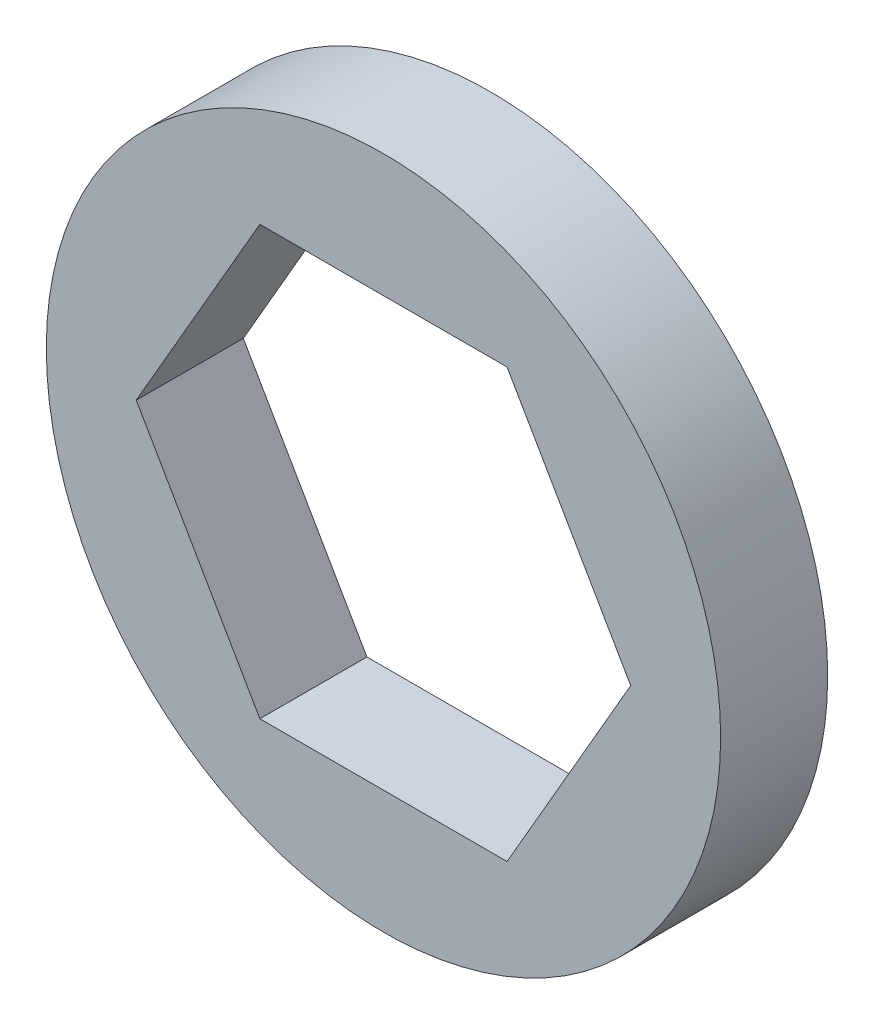
ISO-10303-21;
HEADER;
FILE_DESCRIPTION(('STEP AP214'),'2;1');
FILE_NAME('part.step','',(''),(''),'','','');
FILE_SCHEMA(('AUTOMOTIVE_DESIGN { 1 0 10303 214 1 1 1 1 }'));
ENDSEC;
DATA;
#1=APPLICATION_CONTEXT('core data for automotive mechanical design processes');
#2=APPLICATION_PROTOCOL_DEFINITION('international standard','automotive_design',2000,#1);
#3=PRODUCT_CONTEXT('',#1,'mechanical');
#4=PRODUCT('Part','Part','',(#3));
#5=PRODUCT_RELATED_PRODUCT_CATEGORY('part','',(#4));
#6=PRODUCT_DEFINITION_FORMATION('','',#4);
#7=PRODUCT_DEFINITION_CONTEXT('part definition',#1,'design');
#8=PRODUCT_DEFINITION('design','',#6,#7);
#9=PRODUCT_DEFINITION_SHAPE('','',#8);
#10=(LENGTH_UNIT() NAMED_UNIT(*) SI_UNIT(.MILLI.,.METRE.));
#11=(NAMED_UNIT(*) PLANE_ANGLE_UNIT() SI_UNIT($,.RADIAN.));
#12=(NAMED_UNIT(*) SI_UNIT($,.STERADIAN.) SOLID_ANGLE_UNIT());
#13=UNCERTAINTY_MEASURE_WITH_UNIT(LENGTH_MEASURE(1.E-05),#10,'distance_accuracy_value','');
#14=(GEOMETRIC_REPRESENTATION_CONTEXT(3) GLOBAL_UNCERTAINTY_ASSIGNED_CONTEXT((#13)) GLOBAL_UNIT_ASSIGNED_CONTEXT((#10,
#11,#12)) REPRESENTATION_CONTEXT('',''));
#15=CARTESIAN_POINT('',(0.,0.,0.));
#16=DIRECTION('',(0.,0.,1.));
#17=DIRECTION('',(1.,0.,0.));
#18=AXIS2_PLACEMENT_3D('',#15,#16,#17);
#19=CARTESIAN_POINT('',(-3.66617420935412,-6.35,3.175));
#20=DIRECTION('',(0.,1.,0.));
#21=DIRECTION('',(1.,0.,0.));
#22=AXIS2_PLACEMENT_3D('',#19,#20,#21);
#23=PLANE('',#22);
#24=DIRECTION('',(1.,0.,0.));
#25=VECTOR('',#24,1.);
#26=CARTESIAN_POINT('',(-3.66617420935412,-6.35,0.));
#27=LINE('',#26,#25);
#28=CARTESIAN_POINT('',(-3.66617420935412,-6.35,0.));
#29=VERTEX_POINT('',#28);
#30=CARTESIAN_POINT('',(3.66617420935412,-6.35,0.));
#31=VERTEX_POINT('',#30);
#32=EDGE_CURVE('E126',#29,#31,#27,.T.);
#33=ORIENTED_EDGE('',*,*,#32,.F.);
#34=DIRECTION('',(0.,0.,-1.));
#35=VECTOR('',#34,1.);
#36=CARTESIAN_POINT('',(-3.66617420935412,-6.35,3.175));
#37=LINE('',#36,#35);
#38=CARTESIAN_POINT('',(-3.66617420935412,-6.35,3.175));
#39=VERTEX_POINT('',#38);
#40=EDGE_CURVE('E11',#39,#29,#37,.T.);
#41=ORIENTED_EDGE('',*,*,#40,.F.);
#42=DIRECTION('',(1.,0.,0.));
#43=VECTOR('',#42,1.);
#44=CARTESIAN_POINT('',(-3.66617420935412,-6.35,3.175));
#45=LINE('',#44,#43);
#46=CARTESIAN_POINT('',(3.66617420935412,-6.35,3.175));
#47=VERTEX_POINT('',#46);
#48=EDGE_CURVE('E197',#39,#47,#45,.T.);
#49=ORIENTED_EDGE('',*,*,#48,.T.);
#50=DIRECTION('',(0.,0.,-1.));
#51=VECTOR('',#50,1.);
#52=CARTESIAN_POINT('',(3.66617420935412,-6.35,3.175));
#53=LINE('',#52,#51);
#54=EDGE_CURVE('E131',#47,#31,#53,.T.);
#55=ORIENTED_EDGE('',*,*,#54,.T.);
#56=EDGE_LOOP('',(#33,#41,#49,#55));
#57=FACE_BOUND('',#56,.T.);
#58=ADVANCED_FACE('F17',(#57),#23,.T.);
#59=CARTESIAN_POINT('',(-7.33234841870825,0.,3.175));
#60=DIRECTION('',(0.866025403784439,0.5,0.));
#61=DIRECTION('',(0.,0.,-1.));
#62=AXIS2_PLACEMENT_3D('',#59,#60,#61);
#63=PLANE('',#62);
#64=DIRECTION('',(0.5,-0.866025403784439,0.));
#65=VECTOR('',#64,1.);
#66=CARTESIAN_POINT('',(-7.33234841870825,0.,0.));
#67=LINE('',#66,#65);
#68=CARTESIAN_POINT('',(-7.33234841870825,0.,0.));
#69=VERTEX_POINT('',#68);
#70=EDGE_CURVE('E108',#69,#29,#67,.T.);
#71=ORIENTED_EDGE('',*,*,#70,.F.);
#72=DIRECTION('',(0.,0.,-1.));
#73=VECTOR('',#72,1.);
#74=CARTESIAN_POINT('',(-7.33234841870825,0.,3.175));
#75=LINE('',#74,#73);
#76=CARTESIAN_POINT('',(-7.33234841870825,0.,3.175));
#77=VERTEX_POINT('',#76);
#78=EDGE_CURVE('E21',#77,#69,#75,.T.);
#79=ORIENTED_EDGE('',*,*,#78,.F.);
#80=DIRECTION('',(0.5,-0.866025403784439,0.));
#81=VECTOR('',#80,1.);
#82=CARTESIAN_POINT('',(-7.33234841870825,0.,3.175));
#83=LINE('',#82,#81);
#84=EDGE_CURVE('E208',#77,#39,#83,.T.);
#85=ORIENTED_EDGE('',*,*,#84,.T.);
#86=ORIENTED_EDGE('',*,*,#40,.T.);
#87=EDGE_LOOP('',(#71,#79,#85,#86));
#88=FACE_BOUND('',#87,.T.);
#89=ADVANCED_FACE('F19',(#88),#63,.T.);
#90=CARTESIAN_POINT('',(-3.66617420935412,6.35,3.175));
#91=DIRECTION('',(0.866025403784439,-0.5,0.));
#92=DIRECTION('',(0.,0.,-1.));
#93=AXIS2_PLACEMENT_3D('',#90,#91,#92);
#94=PLANE('',#93);
#95=DIRECTION('',(-0.5,-0.866025403784439,0.));
#96=VECTOR('',#95,1.);
#97=CARTESIAN_POINT('',(-3.66617420935412,6.35,0.));
#98=LINE('',#97,#96);
#99=CARTESIAN_POINT('',(-3.66617420935412,6.35,0.));
#100=VERTEX_POINT('',#99);
#101=EDGE_CURVE('E102',#100,#69,#98,.T.);
#102=ORIENTED_EDGE('',*,*,#101,.F.);
#103=DIRECTION('',(0.,0.,-1.));
#104=VECTOR('',#103,1.);
#105=CARTESIAN_POINT('',(-3.66617420935412,6.35,3.175));
#106=LINE('',#105,#104);
#107=CARTESIAN_POINT('',(-3.66617420935412,6.35,3.175));
#108=VERTEX_POINT('',#107);
#109=EDGE_CURVE('E89',#108,#100,#106,.T.);
#110=ORIENTED_EDGE('',*,*,#109,.F.);
#111=DIRECTION('',(-0.5,-0.866025403784439,0.));
#112=VECTOR('',#111,1.);
#113=CARTESIAN_POINT('',(-3.66617420935412,6.35,3.175));
#114=LINE('',#113,#112);
#115=EDGE_CURVE('E184',#108,#77,#114,.T.);
#116=ORIENTED_EDGE('',*,*,#115,.T.);
#117=ORIENTED_EDGE('',*,*,#78,.T.);
#118=EDGE_LOOP('',(#102,#110,#116,#117));
#119=FACE_BOUND('',#118,.T.);
#120=ADVANCED_FACE('F104',(#119),#94,.T.);
#121=CARTESIAN_POINT('',(3.66617420935412,6.35,3.175));
#122=DIRECTION('',(0.,-1.,0.));
#123=DIRECTION('',(0.,0.,-1.));
#124=AXIS2_PLACEMENT_3D('',#121,#122,#123);
#125=PLANE('',#124);
#126=DIRECTION('',(-1.,0.,0.));
#127=VECTOR('',#126,1.);
#128=CARTESIAN_POINT('',(3.66617420935412,6.35,0.));
#129=LINE('',#128,#127);
#130=CARTESIAN_POINT('',(3.66617420935412,6.35,0.));
#131=VERTEX_POINT('',#130);
#132=EDGE_CURVE('E94',#131,#100,#129,.T.);
#133=ORIENTED_EDGE('',*,*,#132,.F.);
#134=DIRECTION('',(0.,0.,-1.));
#135=VECTOR('',#134,1.);
#136=CARTESIAN_POINT('',(3.66617420935412,6.35,3.175));
#137=LINE('',#136,#135);
#138=CARTESIAN_POINT('',(3.66617420935412,6.35,3.175));
#139=VERTEX_POINT('',#138);
#140=EDGE_CURVE('E85',#139,#131,#137,.T.);
#141=ORIENTED_EDGE('',*,*,#140,.F.);
#142=DIRECTION('',(-1.,0.,0.));
#143=VECTOR('',#142,1.);
#144=CARTESIAN_POINT('',(3.66617420935412,6.35,3.175));
#145=LINE('',#144,#143);
#146=EDGE_CURVE('E100',#139,#108,#145,.T.);
#147=ORIENTED_EDGE('',*,*,#146,.T.);
#148=ORIENTED_EDGE('',*,*,#109,.T.);
#149=EDGE_LOOP('',(#133,#141,#147,#148));
#150=FACE_BOUND('',#149,.T.);
#151=ADVANCED_FACE('F95',(#150),#125,.T.);
#152=CARTESIAN_POINT('',(7.33234841870825,0.,3.175));
#153=DIRECTION('',(-0.866025403784439,-0.5,0.));
#154=DIRECTION('',(-0.5,0.866025403784439,0.));
#155=AXIS2_PLACEMENT_3D('',#152,#153,#154);
#156=PLANE('',#155);
#157=DIRECTION('',(-0.5,0.866025403784439,0.));
#158=VECTOR('',#157,1.);
#159=CARTESIAN_POINT('',(7.33234841870825,0.,0.));
#160=LINE('',#159,#158);
#161=CARTESIAN_POINT('',(7.33234841870825,0.,0.));
#162=VERTEX_POINT('',#161);
#163=EDGE_CURVE('E111',#162,#131,#160,.T.);
#164=ORIENTED_EDGE('',*,*,#163,.F.);
#165=DIRECTION('',(0.,0.,-1.));
#166=VECTOR('',#165,1.);
#167=CARTESIAN_POINT('',(7.33234841870825,0.,3.175));
#168=LINE('',#167,#166);
#169=CARTESIAN_POINT('',(7.33234841870825,0.,3.175));
#170=VERTEX_POINT('',#169);
#171=EDGE_CURVE('E134',#170,#162,#168,.T.);
#172=ORIENTED_EDGE('',*,*,#171,.F.);
#173=DIRECTION('',(-0.5,0.866025403784439,0.));
#174=VECTOR('',#173,1.);
#175=CARTESIAN_POINT('',(7.33234841870825,0.,3.175));
#176=LINE('',#175,#174);
#177=EDGE_CURVE('E196',#170,#139,#176,.T.);
#178=ORIENTED_EDGE('',*,*,#177,.T.);
#179=ORIENTED_EDGE('',*,*,#140,.T.);
#180=EDGE_LOOP('',(#164,#172,#178,#179));
#181=FACE_BOUND('',#180,.T.);
#182=ADVANCED_FACE('F260',(#181),#156,.T.);
#183=CARTESIAN_POINT('',(3.66617420935412,-6.35,3.175));
#184=DIRECTION('',(-0.866025403784439,0.5,0.));
#185=DIRECTION('',(0.,0.,1.));
#186=AXIS2_PLACEMENT_3D('',#183,#184,#185);
#187=PLANE('',#186);
#188=DIRECTION('',(0.5,0.866025403784439,0.));
#189=VECTOR('',#188,1.);
#190=CARTESIAN_POINT('',(3.66617420935412,-6.35,0.));
#191=LINE('',#190,#189);
#192=EDGE_CURVE('E121',#31,#162,#191,.T.);
#193=ORIENTED_EDGE('',*,*,#192,.F.);
#194=ORIENTED_EDGE('',*,*,#54,.F.);
#195=DIRECTION('',(0.5,0.866025403784439,0.));
#196=VECTOR('',#195,1.);
#197=CARTESIAN_POINT('',(3.66617420935412,-6.35,3.175));
#198=LINE('',#197,#196);
#199=EDGE_CURVE('E195',#47,#170,#198,.T.);
#200=ORIENTED_EDGE('',*,*,#199,.T.);
#201=ORIENTED_EDGE('',*,*,#171,.T.);
#202=EDGE_LOOP('',(#193,#194,#200,#201));
#203=FACE_BOUND('',#202,.T.);
#204=ADVANCED_FACE('F272',(#203),#187,.T.);
#205=CARTESIAN_POINT('',(0.,0.,0.));
#206=DIRECTION('',(0.,0.,1.));
#207=DIRECTION('',(1.,0.,0.));
#208=AXIS2_PLACEMENT_3D('',#205,#206,#207);
#209=PLANE('',#208);
#210=ORIENTED_EDGE('',*,*,#192,.T.);
#211=ORIENTED_EDGE('',*,*,#163,.T.);
#212=ORIENTED_EDGE('',*,*,#132,.T.);
#213=ORIENTED_EDGE('',*,*,#101,.T.);
#214=ORIENTED_EDGE('',*,*,#70,.T.);
#215=ORIENTED_EDGE('',*,*,#32,.T.);
#216=EDGE_LOOP('',(#210,#211,#212,#213,#214,#215));
#217=FACE_BOUND('',#216,.T.);
#218=CARTESIAN_POINT('',(0.,0.,0.));
#219=DIRECTION('',(0.,0.,1.));
#220=DIRECTION('',(1.,0.,0.));
#221=AXIS2_PLACEMENT_3D('',#218,#219,#220);
#222=CIRCLE('',#221,10.);
#223=CARTESIAN_POINT('',(10.,0.,0.));
#224=VERTEX_POINT('',#223);
#225=EDGE_CURVE('E357',#224,#224,#222,.T.);
#226=ORIENTED_EDGE('',*,*,#225,.F.);
#227=EDGE_LOOP('',(#226));
#228=FACE_BOUND('',#227,.T.);
#229=ADVANCED_FACE('F115',(#217,#228),#209,.F.);
#230=CARTESIAN_POINT('',(0.,0.,3.175));
#231=DIRECTION('',(0.,0.,1.));
#232=DIRECTION('',(1.,0.,0.));
#233=AXIS2_PLACEMENT_3D('',#230,#231,#232);
#234=PLANE('',#233);
#235=ORIENTED_EDGE('',*,*,#177,.F.);
#236=ORIENTED_EDGE('',*,*,#199,.F.);
#237=ORIENTED_EDGE('',*,*,#48,.F.);
#238=ORIENTED_EDGE('',*,*,#84,.F.);
#239=ORIENTED_EDGE('',*,*,#115,.F.);
#240=ORIENTED_EDGE('',*,*,#146,.F.);
#241=EDGE_LOOP('',(#235,#236,#237,#238,#239,#240));
#242=FACE_BOUND('',#241,.T.);
#243=CARTESIAN_POINT('',(0.,0.,3.175));
#244=DIRECTION('',(0.,0.,1.));
#245=DIRECTION('',(1.,0.,0.));
#246=AXIS2_PLACEMENT_3D('',#243,#244,#245);
#247=CIRCLE('',#246,10.);
#248=CARTESIAN_POINT('',(10.,0.,3.175));
#249=VERTEX_POINT('',#248);
#250=EDGE_CURVE('E365',#249,#249,#247,.T.);
#251=ORIENTED_EDGE('',*,*,#250,.T.);
#252=EDGE_LOOP('',(#251));
#253=FACE_BOUND('',#252,.T.);
#254=ADVANCED_FACE('F247',(#242,#253),#234,.T.);
#255=CARTESIAN_POINT('',(0.,0.,3.175));
#256=DIRECTION('',(0.,0.,-1.));
#257=DIRECTION('',(-1.,0.,0.));
#258=AXIS2_PLACEMENT_3D('',#255,#256,#257);
#259=CYLINDRICAL_SURFACE('',#258,10.);
#260=ORIENTED_EDGE('',*,*,#225,.T.);
#261=EDGE_LOOP('',(#260));
#262=FACE_BOUND('',#261,.T.);
#263=ORIENTED_EDGE('',*,*,#250,.F.);
#264=EDGE_LOOP('',(#263));
#265=FACE_BOUND('',#264,.T.);
#266=ADVANCED_FACE('F244',(#262,#265),#259,.T.);
#267=CLOSED_SHELL('',(#58,#89,#120,#151,#182,#204,#229,#254,#266));
#268=MANIFOLD_SOLID_BREP('B1',#267);
#269=ADVANCED_BREP_SHAPE_REPRESENTATION('',(#18,#268),#14);
#270=SHAPE_DEFINITION_REPRESENTATION(#9,#269);
ENDSEC;
END-ISO-10303-21;
